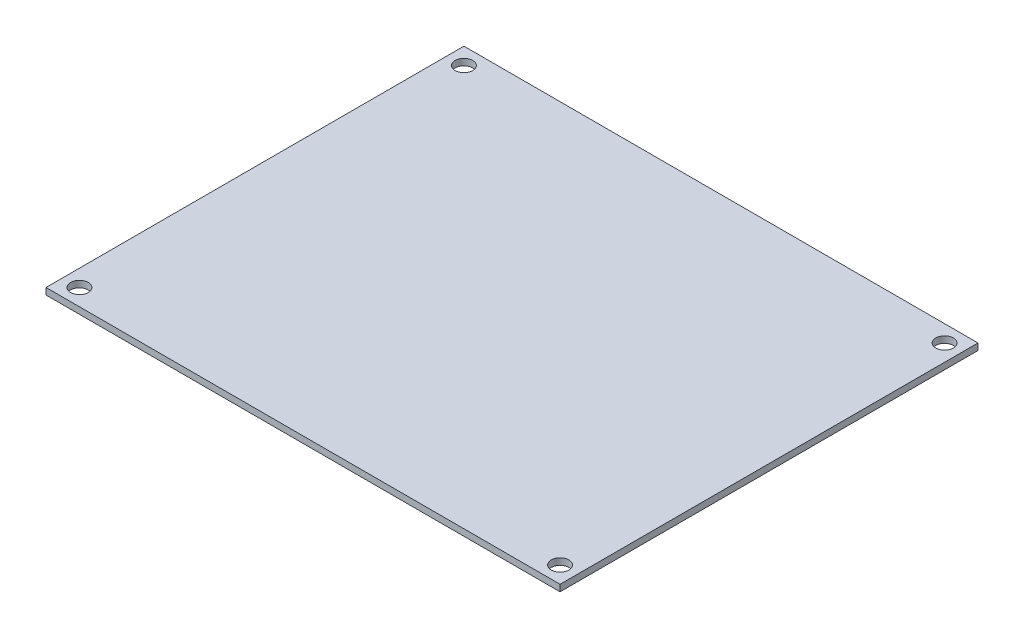
ISO-10303-21;
HEADER;
FILE_DESCRIPTION(('STEP AP214'),'2;1');
FILE_NAME('part.step','',(''),(''),'','','');
FILE_SCHEMA(('AUTOMOTIVE_DESIGN { 1 0 10303 214 1 1 1 1 }'));
ENDSEC;
DATA;
#1=APPLICATION_CONTEXT('core data for automotive mechanical design processes');
#2=APPLICATION_PROTOCOL_DEFINITION('international standard','automotive_design',2000,#1);
#3=PRODUCT_CONTEXT('',#1,'mechanical');
#4=PRODUCT('Part','Part','',(#3));
#5=PRODUCT_RELATED_PRODUCT_CATEGORY('part','',(#4));
#6=PRODUCT_DEFINITION_FORMATION('','',#4);
#7=PRODUCT_DEFINITION_CONTEXT('part definition',#1,'design');
#8=PRODUCT_DEFINITION('design','',#6,#7);
#9=PRODUCT_DEFINITION_SHAPE('','',#8);
#10=(LENGTH_UNIT() NAMED_UNIT(*) SI_UNIT(.MILLI.,.METRE.));
#11=(NAMED_UNIT(*) PLANE_ANGLE_UNIT() SI_UNIT($,.RADIAN.));
#12=(NAMED_UNIT(*) SI_UNIT($,.STERADIAN.) SOLID_ANGLE_UNIT());
#13=UNCERTAINTY_MEASURE_WITH_UNIT(LENGTH_MEASURE(1.E-05),#10,'distance_accuracy_value','');
#14=(GEOMETRIC_REPRESENTATION_CONTEXT(3) GLOBAL_UNCERTAINTY_ASSIGNED_CONTEXT((#13)) GLOBAL_UNIT_ASSIGNED_CONTEXT((#10,
#11,#12)) REPRESENTATION_CONTEXT('',''));
#15=CARTESIAN_POINT('',(0.,0.,0.));
#16=DIRECTION('',(0.,0.,1.));
#17=DIRECTION('',(1.,0.,0.));
#18=AXIS2_PLACEMENT_3D('',#15,#16,#17);
#19=CARTESIAN_POINT('',(0.,0.,0.));
#20=DIRECTION('',(0.,-1.,0.));
#21=DIRECTION('',(0.,0.,-1.));
#22=AXIS2_PLACEMENT_3D('',#19,#20,#21);
#23=PLANE('',#22);
#24=CARTESIAN_POINT('',(3.99999999999999,0.,-4.));
#25=DIRECTION('',(0.,-1.,0.));
#26=DIRECTION('',(0.,0.,-1.));
#27=AXIS2_PLACEMENT_3D('',#24,#25,#26);
#28=CIRCLE('',#27,2.1);
#29=CARTESIAN_POINT('',(3.99999999999999,0.,-6.1));
#30=VERTEX_POINT('',#29);
#31=EDGE_CURVE('E90',#30,#30,#28,.F.);
#32=ORIENTED_EDGE('',*,*,#31,.T.);
#33=EDGE_LOOP('',(#32));
#34=FACE_BOUND('',#33,.T.);
#35=CARTESIAN_POINT('',(119.,0.,-96.));
#36=DIRECTION('',(0.,-1.,0.));
#37=DIRECTION('',(0.,0.,-1.));
#38=AXIS2_PLACEMENT_3D('',#35,#36,#37);
#39=CIRCLE('',#38,2.1);
#40=CARTESIAN_POINT('',(119.,0.,-98.1));
#41=VERTEX_POINT('',#40);
#42=EDGE_CURVE('E95',#41,#41,#39,.F.);
#43=ORIENTED_EDGE('',*,*,#42,.T.);
#44=EDGE_LOOP('',(#43));
#45=FACE_BOUND('',#44,.T.);
#46=DIRECTION('',(0.,0.,1.));
#47=VECTOR('',#46,1.);
#48=CARTESIAN_POINT('',(123.,0.,0.));
#49=LINE('',#48,#47);
#50=CARTESIAN_POINT('',(123.,0.,-100.));
#51=VERTEX_POINT('',#50);
#52=CARTESIAN_POINT('',(123.,0.,0.));
#53=VERTEX_POINT('',#52);
#54=EDGE_CURVE('E56',#51,#53,#49,.T.);
#55=ORIENTED_EDGE('',*,*,#54,.T.);
#56=DIRECTION('',(-1.,0.,0.));
#57=VECTOR('',#56,1.);
#58=CARTESIAN_POINT('',(0.,0.,0.));
#59=LINE('',#58,#57);
#60=CARTESIAN_POINT('',(0.,0.,0.));
#61=VERTEX_POINT('',#60);
#62=EDGE_CURVE('E108',#53,#61,#59,.T.);
#63=ORIENTED_EDGE('',*,*,#62,.T.);
#64=DIRECTION('',(0.,0.,-1.));
#65=VECTOR('',#64,1.);
#66=CARTESIAN_POINT('',(0.,0.,0.));
#67=LINE('',#66,#65);
#68=CARTESIAN_POINT('',(0.,0.,-100.));
#69=VERTEX_POINT('',#68);
#70=EDGE_CURVE('E61',#61,#69,#67,.T.);
#71=ORIENTED_EDGE('',*,*,#70,.T.);
#72=DIRECTION('',(1.,0.,0.));
#73=VECTOR('',#72,1.);
#74=CARTESIAN_POINT('',(0.,0.,-100.));
#75=LINE('',#74,#73);
#76=EDGE_CURVE('E59',#69,#51,#75,.T.);
#77=ORIENTED_EDGE('',*,*,#76,.T.);
#78=EDGE_LOOP('',(#55,#63,#71,#77));
#79=FACE_BOUND('',#78,.T.);
#80=CARTESIAN_POINT('',(3.99999999999999,0.,-96.));
#81=DIRECTION('',(0.,-1.,0.));
#82=DIRECTION('',(0.,0.,-1.));
#83=AXIS2_PLACEMENT_3D('',#80,#81,#82);
#84=CIRCLE('',#83,2.1);
#85=CARTESIAN_POINT('',(3.99999999999999,0.,-98.1));
#86=VERTEX_POINT('',#85);
#87=EDGE_CURVE('E20',#86,#86,#84,.F.);
#88=ORIENTED_EDGE('',*,*,#87,.T.);
#89=EDGE_LOOP('',(#88));
#90=FACE_BOUND('',#89,.T.);
#91=CARTESIAN_POINT('',(119.,0.,-4.));
#92=DIRECTION('',(0.,-1.,0.));
#93=DIRECTION('',(0.,0.,-1.));
#94=AXIS2_PLACEMENT_3D('',#91,#92,#93);
#95=CIRCLE('',#94,2.1);
#96=CARTESIAN_POINT('',(119.,0.,-6.10000000000001));
#97=VERTEX_POINT('',#96);
#98=EDGE_CURVE('E93',#97,#97,#95,.F.);
#99=ORIENTED_EDGE('',*,*,#98,.T.);
#100=EDGE_LOOP('',(#99));
#101=FACE_BOUND('',#100,.T.);
#102=ADVANCED_FACE('F17',(#34,#45,#79,#90,#101),#23,.T.);
#103=CARTESIAN_POINT('',(0.,1.57,-100.));
#104=DIRECTION('',(0.,0.,1.));
#105=DIRECTION('',(1.,0.,0.));
#106=AXIS2_PLACEMENT_3D('',#103,#104,#105);
#107=PLANE('',#106);
#108=DIRECTION('',(0.,1.,0.));
#109=VECTOR('',#108,1.);
#110=CARTESIAN_POINT('',(0.,1.57,-100.));
#111=LINE('',#110,#109);
#112=CARTESIAN_POINT('',(0.,1.57,-100.));
#113=VERTEX_POINT('',#112);
#114=EDGE_CURVE('E102',#69,#113,#111,.T.);
#115=ORIENTED_EDGE('',*,*,#114,.T.);
#116=DIRECTION('',(1.,0.,0.));
#117=VECTOR('',#116,1.);
#118=CARTESIAN_POINT('',(0.,1.57,-100.));
#119=LINE('',#118,#117);
#120=CARTESIAN_POINT('',(123.,1.57,-100.));
#121=VERTEX_POINT('',#120);
#122=EDGE_CURVE('E77',#113,#121,#119,.T.);
#123=ORIENTED_EDGE('',*,*,#122,.T.);
#124=DIRECTION('',(0.,1.,0.));
#125=VECTOR('',#124,1.);
#126=CARTESIAN_POINT('',(123.,1.57,-100.));
#127=LINE('',#126,#125);
#128=EDGE_CURVE('E66',#121,#51,#127,.F.);
#129=ORIENTED_EDGE('',*,*,#128,.T.);
#130=ORIENTED_EDGE('',*,*,#76,.F.);
#131=EDGE_LOOP('',(#115,#123,#129,#130));
#132=FACE_BOUND('',#131,.T.);
#133=ADVANCED_FACE('F76',(#132),#107,.F.);
#134=CARTESIAN_POINT('',(123.,1.57,0.));
#135=DIRECTION('',(-1.,0.,0.));
#136=DIRECTION('',(0.,0.,1.));
#137=AXIS2_PLACEMENT_3D('',#134,#135,#136);
#138=PLANE('',#137);
#139=ORIENTED_EDGE('',*,*,#128,.F.);
#140=DIRECTION('',(0.,0.,-1.));
#141=VECTOR('',#140,1.);
#142=CARTESIAN_POINT('',(123.,1.57,0.));
#143=LINE('',#142,#141);
#144=CARTESIAN_POINT('',(123.,1.57,0.));
#145=VERTEX_POINT('',#144);
#146=EDGE_CURVE('E116',#121,#145,#143,.F.);
#147=ORIENTED_EDGE('',*,*,#146,.T.);
#148=DIRECTION('',(0.,1.,0.));
#149=VECTOR('',#148,1.);
#150=CARTESIAN_POINT('',(123.,1.57,0.));
#151=LINE('',#150,#149);
#152=EDGE_CURVE('E73',#145,#53,#151,.F.);
#153=ORIENTED_EDGE('',*,*,#152,.T.);
#154=ORIENTED_EDGE('',*,*,#54,.F.);
#155=EDGE_LOOP('',(#139,#147,#153,#154));
#156=FACE_BOUND('',#155,.T.);
#157=ADVANCED_FACE('F70',(#156),#138,.F.);
#158=CARTESIAN_POINT('',(0.,1.57,0.));
#159=DIRECTION('',(0.,0.,-1.));
#160=DIRECTION('',(-1.,0.,0.));
#161=AXIS2_PLACEMENT_3D('',#158,#159,#160);
#162=PLANE('',#161);
#163=ORIENTED_EDGE('',*,*,#152,.F.);
#164=DIRECTION('',(1.,0.,0.));
#165=VECTOR('',#164,1.);
#166=CARTESIAN_POINT('',(0.,1.57,0.));
#167=LINE('',#166,#165);
#168=CARTESIAN_POINT('',(0.,1.57,0.));
#169=VERTEX_POINT('',#168);
#170=EDGE_CURVE('E114',#145,#169,#167,.F.);
#171=ORIENTED_EDGE('',*,*,#170,.T.);
#172=DIRECTION('',(0.,1.,0.));
#173=VECTOR('',#172,1.);
#174=CARTESIAN_POINT('',(0.,1.57,0.));
#175=LINE('',#174,#173);
#176=EDGE_CURVE('E35',#169,#61,#175,.F.);
#177=ORIENTED_EDGE('',*,*,#176,.T.);
#178=ORIENTED_EDGE('',*,*,#62,.F.);
#179=EDGE_LOOP('',(#163,#171,#177,#178));
#180=FACE_BOUND('',#179,.T.);
#181=ADVANCED_FACE('F112',(#180),#162,.F.);
#182=CARTESIAN_POINT('',(0.,1.57,0.));
#183=DIRECTION('',(1.,0.,0.));
#184=DIRECTION('',(0.,0.,-1.));
#185=AXIS2_PLACEMENT_3D('',#182,#183,#184);
#186=PLANE('',#185);
#187=ORIENTED_EDGE('',*,*,#176,.F.);
#188=DIRECTION('',(0.,0.,-1.));
#189=VECTOR('',#188,1.);
#190=CARTESIAN_POINT('',(0.,1.57,0.));
#191=LINE('',#190,#189);
#192=EDGE_CURVE('E89',#169,#113,#191,.T.);
#193=ORIENTED_EDGE('',*,*,#192,.T.);
#194=ORIENTED_EDGE('',*,*,#114,.F.);
#195=ORIENTED_EDGE('',*,*,#70,.F.);
#196=EDGE_LOOP('',(#187,#193,#194,#195));
#197=FACE_BOUND('',#196,.T.);
#198=ADVANCED_FACE('F110',(#197),#186,.F.);
#199=CARTESIAN_POINT('',(3.99999999999999,1.57,-96.));
#200=DIRECTION('',(0.,-1.,0.));
#201=DIRECTION('',(0.,0.,-1.));
#202=AXIS2_PLACEMENT_3D('',#199,#200,#201);
#203=CYLINDRICAL_SURFACE('',#202,2.1);
#204=ORIENTED_EDGE('',*,*,#87,.F.);
#205=EDGE_LOOP('',(#204));
#206=FACE_BOUND('',#205,.T.);
#207=CARTESIAN_POINT('',(3.99999999999999,1.57,-96.));
#208=DIRECTION('',(0.,-1.,0.));
#209=DIRECTION('',(0.,0.,-1.));
#210=AXIS2_PLACEMENT_3D('',#207,#208,#209);
#211=CIRCLE('',#210,2.1);
#212=CARTESIAN_POINT('',(3.99999999999999,1.57,-98.1));
#213=VERTEX_POINT('',#212);
#214=EDGE_CURVE('E86',#213,#213,#211,.F.);
#215=ORIENTED_EDGE('',*,*,#214,.T.);
#216=EDGE_LOOP('',(#215));
#217=FACE_BOUND('',#216,.T.);
#218=ADVANCED_FACE('F140',(#206,#217),#203,.F.);
#219=CARTESIAN_POINT('',(119.,1.57,-96.));
#220=DIRECTION('',(0.,-1.,0.));
#221=DIRECTION('',(0.,0.,-1.));
#222=AXIS2_PLACEMENT_3D('',#219,#220,#221);
#223=CYLINDRICAL_SURFACE('',#222,2.1);
#224=ORIENTED_EDGE('',*,*,#42,.F.);
#225=EDGE_LOOP('',(#224));
#226=FACE_BOUND('',#225,.T.);
#227=CARTESIAN_POINT('',(119.,1.57,-96.));
#228=DIRECTION('',(0.,-1.,0.));
#229=DIRECTION('',(0.,0.,-1.));
#230=AXIS2_PLACEMENT_3D('',#227,#228,#229);
#231=CIRCLE('',#230,2.1);
#232=CARTESIAN_POINT('',(119.,1.57,-98.1));
#233=VERTEX_POINT('',#232);
#234=EDGE_CURVE('E83',#233,#233,#231,.F.);
#235=ORIENTED_EDGE('',*,*,#234,.T.);
#236=EDGE_LOOP('',(#235));
#237=FACE_BOUND('',#236,.T.);
#238=ADVANCED_FACE('F136',(#226,#237),#223,.F.);
#239=CARTESIAN_POINT('',(119.,1.57,-4.));
#240=DIRECTION('',(0.,-1.,0.));
#241=DIRECTION('',(0.,0.,-1.));
#242=AXIS2_PLACEMENT_3D('',#239,#240,#241);
#243=CYLINDRICAL_SURFACE('',#242,2.1);
#244=ORIENTED_EDGE('',*,*,#98,.F.);
#245=EDGE_LOOP('',(#244));
#246=FACE_BOUND('',#245,.T.);
#247=CARTESIAN_POINT('',(119.,1.57,-4.));
#248=DIRECTION('',(0.,-1.,0.));
#249=DIRECTION('',(0.,0.,-1.));
#250=AXIS2_PLACEMENT_3D('',#247,#248,#249);
#251=CIRCLE('',#250,2.1);
#252=CARTESIAN_POINT('',(119.,1.57,-6.10000000000001));
#253=VERTEX_POINT('',#252);
#254=EDGE_CURVE('E26',#253,#253,#251,.F.);
#255=ORIENTED_EDGE('',*,*,#254,.T.);
#256=EDGE_LOOP('',(#255));
#257=FACE_BOUND('',#256,.T.);
#258=ADVANCED_FACE('F128',(#246,#257),#243,.F.);
#259=CARTESIAN_POINT('',(3.99999999999999,1.57,-4.));
#260=DIRECTION('',(0.,-1.,0.));
#261=DIRECTION('',(0.,0.,-1.));
#262=AXIS2_PLACEMENT_3D('',#259,#260,#261);
#263=CYLINDRICAL_SURFACE('',#262,2.1);
#264=ORIENTED_EDGE('',*,*,#31,.F.);
#265=EDGE_LOOP('',(#264));
#266=FACE_BOUND('',#265,.T.);
#267=CARTESIAN_POINT('',(3.99999999999999,1.57,-4.));
#268=DIRECTION('',(0.,-1.,0.));
#269=DIRECTION('',(0.,0.,-1.));
#270=AXIS2_PLACEMENT_3D('',#267,#268,#269);
#271=CIRCLE('',#270,2.1);
#272=CARTESIAN_POINT('',(3.99999999999999,1.57,-6.1));
#273=VERTEX_POINT('',#272);
#274=EDGE_CURVE('E11',#273,#273,#271,.F.);
#275=ORIENTED_EDGE('',*,*,#274,.T.);
#276=EDGE_LOOP('',(#275));
#277=FACE_BOUND('',#276,.T.);
#278=ADVANCED_FACE('F121',(#266,#277),#263,.F.);
#279=CARTESIAN_POINT('',(0.,1.57,0.));
#280=DIRECTION('',(0.,-1.,0.));
#281=DIRECTION('',(0.,0.,-1.));
#282=AXIS2_PLACEMENT_3D('',#279,#280,#281);
#283=PLANE('',#282);
#284=ORIENTED_EDGE('',*,*,#274,.F.);
#285=EDGE_LOOP('',(#284));
#286=FACE_BOUND('',#285,.T.);
#287=ORIENTED_EDGE('',*,*,#254,.F.);
#288=EDGE_LOOP('',(#287));
#289=FACE_BOUND('',#288,.T.);
#290=ORIENTED_EDGE('',*,*,#234,.F.);
#291=EDGE_LOOP('',(#290));
#292=FACE_BOUND('',#291,.T.);
#293=ORIENTED_EDGE('',*,*,#214,.F.);
#294=EDGE_LOOP('',(#293));
#295=FACE_BOUND('',#294,.T.);
#296=ORIENTED_EDGE('',*,*,#170,.F.);
#297=ORIENTED_EDGE('',*,*,#146,.F.);
#298=ORIENTED_EDGE('',*,*,#122,.F.);
#299=ORIENTED_EDGE('',*,*,#192,.F.);
#300=EDGE_LOOP('',(#296,#297,#298,#299));
#301=FACE_BOUND('',#300,.T.);
#302=ADVANCED_FACE('F119',(#286,#289,#292,#295,#301),#283,.F.);
#303=CLOSED_SHELL('',(#102,#133,#157,#181,#198,#218,#238,#258,#278,#302));
#304=MANIFOLD_SOLID_BREP('B1',#303);
#305=ADVANCED_BREP_SHAPE_REPRESENTATION('',(#18,#304),#14);
#306=SHAPE_DEFINITION_REPRESENTATION(#9,#305);
ENDSEC;
END-ISO-10303-21;
